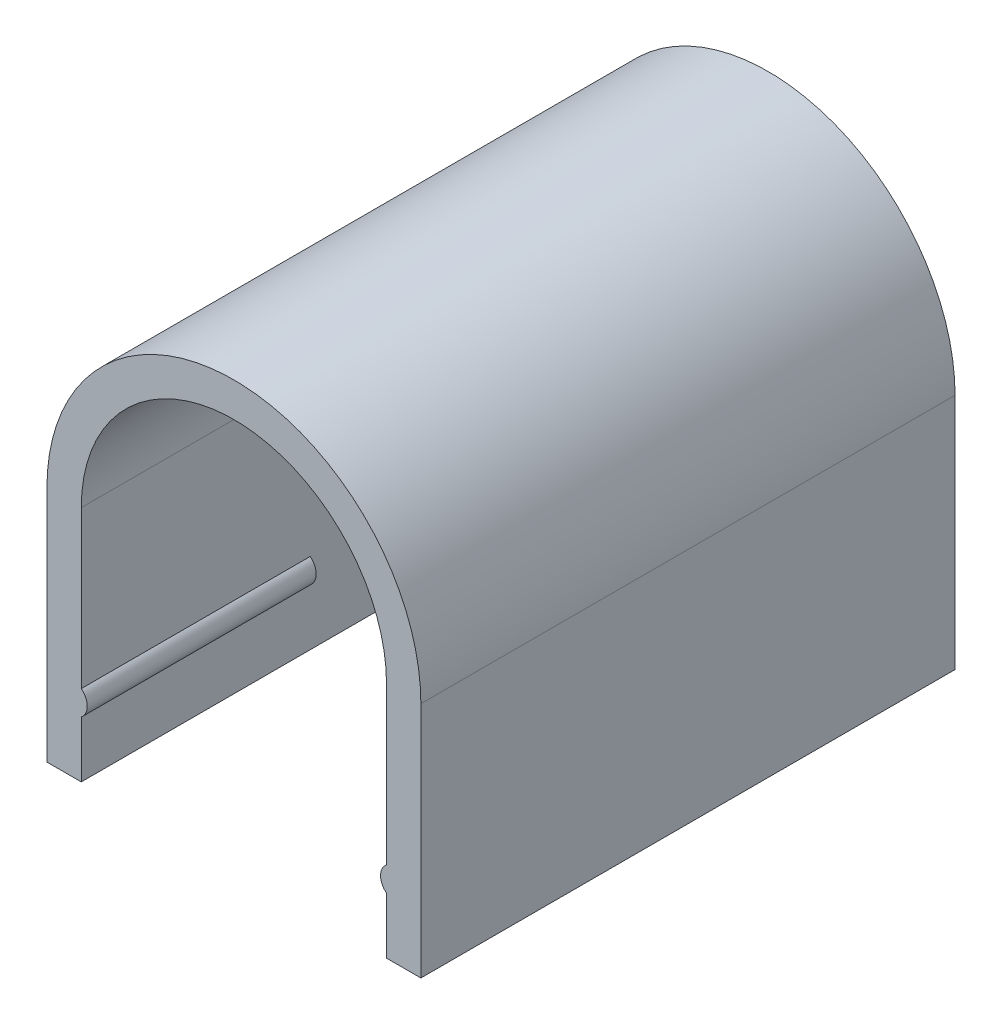
ISO-10303-21;
HEADER;
FILE_DESCRIPTION(('STEP AP214'),'2;1');
FILE_NAME('part.step','',(''),(''),'','','');
FILE_SCHEMA(('AUTOMOTIVE_DESIGN { 1 0 10303 214 1 1 1 1 }'));
ENDSEC;
DATA;
#1=APPLICATION_CONTEXT('core data for automotive mechanical design processes');
#2=APPLICATION_PROTOCOL_DEFINITION('international standard','automotive_design',2000,#1);
#3=PRODUCT_CONTEXT('',#1,'mechanical');
#4=PRODUCT('Part','Part','',(#3));
#5=PRODUCT_RELATED_PRODUCT_CATEGORY('part','',(#4));
#6=PRODUCT_DEFINITION_FORMATION('','',#4);
#7=PRODUCT_DEFINITION_CONTEXT('part definition',#1,'design');
#8=PRODUCT_DEFINITION('design','',#6,#7);
#9=PRODUCT_DEFINITION_SHAPE('','',#8);
#10=(LENGTH_UNIT() NAMED_UNIT(*) SI_UNIT(.MILLI.,.METRE.));
#11=(NAMED_UNIT(*) PLANE_ANGLE_UNIT() SI_UNIT($,.RADIAN.));
#12=(NAMED_UNIT(*) SI_UNIT($,.STERADIAN.) SOLID_ANGLE_UNIT());
#13=UNCERTAINTY_MEASURE_WITH_UNIT(LENGTH_MEASURE(1.E-05),#10,'distance_accuracy_value','');
#14=(GEOMETRIC_REPRESENTATION_CONTEXT(3) GLOBAL_UNCERTAINTY_ASSIGNED_CONTEXT((#13)) GLOBAL_UNIT_ASSIGNED_CONTEXT((#10,
#11,#12)) REPRESENTATION_CONTEXT('',''));
#15=CARTESIAN_POINT('',(0.,0.,0.));
#16=DIRECTION('',(0.,0.,1.));
#17=DIRECTION('',(1.,0.,0.));
#18=AXIS2_PLACEMENT_3D('',#15,#16,#17);
#19=CARTESIAN_POINT('',(8.94999999999984,424.435617565556,316.263553390594));
#20=DIRECTION('',(-1.,0.,0.));
#21=DIRECTION('',(0.,0.,1.));
#22=AXIS2_PLACEMENT_3D('',#19,#20,#21);
#23=PLANE('',#22);
#24=DIRECTION('',(0.,0.,1.));
#25=VECTOR('',#24,1.);
#26=CARTESIAN_POINT('',(8.94999999999984,439.999617565556,319.000000000001));
#27=LINE('',#26,#25);
#28=CARTESIAN_POINT('',(8.94999999999983,439.999617565556,316.263553390594));
#29=VERTEX_POINT('',#28);
#30=CARTESIAN_POINT('',(8.94999999999983,439.999617565556,321.736446609408));
#31=VERTEX_POINT('',#30);
#32=EDGE_CURVE('E129',#29,#31,#27,.T.);
#33=ORIENTED_EDGE('',*,*,#32,.F.);
#34=DIRECTION('',(0.,1.,0.));
#35=VECTOR('',#34,1.);
#36=CARTESIAN_POINT('',(8.94999999999979,424.435617565556,316.263553390594));
#37=LINE('',#36,#35);
#38=CARTESIAN_POINT('',(8.94999999999982,424.435617565556,316.263553390594));
#39=VERTEX_POINT('',#38);
#40=EDGE_CURVE('E104',#39,#29,#37,.T.);
#41=ORIENTED_EDGE('',*,*,#40,.F.);
#42=DIRECTION('',(0.,0.,-1.));
#43=VECTOR('',#42,1.);
#44=CARTESIAN_POINT('',(8.94999999999983,424.435617565556,329.000000000001));
#45=LINE('',#44,#43);
#46=CARTESIAN_POINT('',(8.94999999999983,424.435617565556,321.736446609408));
#47=VERTEX_POINT('',#46);
#48=EDGE_CURVE('E160',#47,#39,#45,.T.);
#49=ORIENTED_EDGE('',*,*,#48,.F.);
#50=DIRECTION('',(0.,1.,0.));
#51=VECTOR('',#50,1.);
#52=CARTESIAN_POINT('',(8.94999999999983,424.435617565556,321.736446609408));
#53=LINE('',#52,#51);
#54=EDGE_CURVE('E113',#31,#47,#53,.F.);
#55=ORIENTED_EDGE('',*,*,#54,.F.);
#56=EDGE_LOOP('',(#33,#41,#49,#55));
#57=FACE_BOUND('',#56,.T.);
#58=ADVANCED_FACE('F16',(#57),#23,.T.);
#59=CARTESIAN_POINT('',(9.80466798838485,428.925799984371,329.000000000001));
#60=DIRECTION('',(0.,0.,1.));
#61=DIRECTION('',(1.,0.,0.));
#62=AXIS2_PLACEMENT_3D('',#59,#60,#61);
#63=PLANE('',#62);
#64=DIRECTION('',(0.,1.,0.));
#65=VECTOR('',#64,1.);
#66=CARTESIAN_POINT('',(9.99999999999972,428.925799984371,329.000000000001));
#67=LINE('',#66,#65);
#68=CARTESIAN_POINT('',(9.99999999999972,428.122860904432,329.000000000001));
#69=VERTEX_POINT('',#68);
#70=CARTESIAN_POINT('',(9.99999999999972,429.728739064309,329.000000000001));
#71=VERTEX_POINT('',#70);
#72=EDGE_CURVE('E91',#69,#71,#67,.T.);
#73=ORIENTED_EDGE('',*,*,#72,.F.);
#74=CARTESIAN_POINT('',(10.6298158491508,428.925799984371,329.000000000001));
#75=DIRECTION('',(0.,0.,-1.));
#76=DIRECTION('',(-1.,0.,0.));
#77=AXIS2_PLACEMENT_3D('',#74,#75,#76);
#78=CIRCLE('',#77,1.02047987238082);
#79=EDGE_CURVE('E19',#71,#69,#78,.F.);
#80=ORIENTED_EDGE('',*,*,#79,.F.);
#81=EDGE_LOOP('',(#73,#80));
#82=FACE_BOUND('',#81,.T.);
#83=ADVANCED_FACE('F613',(#82),#63,.F.);
#84=CARTESIAN_POINT('',(9.99999999999972,424.435617565556,315.213553390594));
#85=DIRECTION('',(-0.707106781186553,0.,-0.707106781186542));
#86=DIRECTION('',(-0.707106781186542,0.,0.707106781186553));
#87=AXIS2_PLACEMENT_3D('',#84,#85,#86);
#88=PLANE('',#87);
#89=DIRECTION('',(-0.707106781186508,0.,0.707106781186587));
#90=VECTOR('',#89,1.);
#91=CARTESIAN_POINT('',(9.99999999999972,439.999617565556,315.213553390594));
#92=LINE('',#91,#90);
#93=CARTESIAN_POINT('',(9.99999999999971,439.999617565556,315.213553390594));
#94=VERTEX_POINT('',#93);
#95=EDGE_CURVE('E132',#94,#29,#92,.T.);
#96=ORIENTED_EDGE('',*,*,#95,.F.);
#97=DIRECTION('',(0.,-1.,0.));
#98=VECTOR('',#97,1.);
#99=CARTESIAN_POINT('',(9.99999999999972,424.435617565556,315.213553390594));
#100=LINE('',#99,#98);
#101=CARTESIAN_POINT('',(9.99999999999972,424.435617565556,315.213553390594));
#102=VERTEX_POINT('',#101);
#103=EDGE_CURVE('E154',#102,#94,#100,.F.);
#104=ORIENTED_EDGE('',*,*,#103,.F.);
#105=DIRECTION('',(0.707106781186508,0.,-0.707106781186587));
#106=VECTOR('',#105,1.);
#107=CARTESIAN_POINT('',(8.94999999999984,424.435617565556,316.263553390594));
#108=LINE('',#107,#106);
#109=EDGE_CURVE('E138',#39,#102,#108,.T.);
#110=ORIENTED_EDGE('',*,*,#109,.F.);
#111=ORIENTED_EDGE('',*,*,#40,.T.);
#112=EDGE_LOOP('',(#96,#104,#110,#111));
#113=FACE_BOUND('',#112,.T.);
#114=ADVANCED_FACE('F135',(#113),#88,.T.);
#115=CARTESIAN_POINT('',(9.47499999999978,439.999617565556,319.000000000001));
#116=DIRECTION('',(0.,1.,0.));
#117=DIRECTION('',(0.,0.,1.));
#118=AXIS2_PLACEMENT_3D('',#115,#116,#117);
#119=PLANE('',#118);
#120=DIRECTION('',(0.,0.,1.));
#121=VECTOR('',#120,1.);
#122=CARTESIAN_POINT('',(9.99999999999971,439.999617565556,329.000000000001));
#123=LINE('',#122,#121);
#124=CARTESIAN_POINT('',(9.99999999999974,439.999617565556,322.786446609408));
#125=VERTEX_POINT('',#124);
#126=EDGE_CURVE('E143',#94,#125,#123,.T.);
#127=ORIENTED_EDGE('',*,*,#126,.F.);
#128=ORIENTED_EDGE('',*,*,#95,.T.);
#129=ORIENTED_EDGE('',*,*,#32,.T.);
#130=DIRECTION('',(0.707106781186564,0.,0.707106781186532));
#131=VECTOR('',#130,1.);
#132=CARTESIAN_POINT('',(8.94999999999983,439.999617565556,321.736446609408));
#133=LINE('',#132,#131);
#134=EDGE_CURVE('E145',#125,#31,#133,.F.);
#135=ORIENTED_EDGE('',*,*,#134,.F.);
#136=EDGE_LOOP('',(#127,#128,#129,#135));
#137=FACE_BOUND('',#136,.T.);
#138=ADVANCED_FACE('F141',(#137),#119,.T.);
#139=CARTESIAN_POINT('',(8.94999999999983,424.435617565556,321.736446609408));
#140=DIRECTION('',(-0.707106781186532,0.,0.707106781186564));
#141=DIRECTION('',(0.707106781186564,0.,0.707106781186532));
#142=AXIS2_PLACEMENT_3D('',#139,#140,#141);
#143=PLANE('',#142);
#144=ORIENTED_EDGE('',*,*,#134,.T.);
#145=ORIENTED_EDGE('',*,*,#54,.T.);
#146=DIRECTION('',(-0.707106781186511,0.,-0.707106781186584));
#147=VECTOR('',#146,1.);
#148=CARTESIAN_POINT('',(9.99999999999972,424.435617565556,322.786446609408));
#149=LINE('',#148,#147);
#150=CARTESIAN_POINT('',(9.99999999999972,424.435617565556,322.786446609408));
#151=VERTEX_POINT('',#150);
#152=EDGE_CURVE('E167',#151,#47,#149,.T.);
#153=ORIENTED_EDGE('',*,*,#152,.F.);
#154=DIRECTION('',(0.,-1.,0.));
#155=VECTOR('',#154,1.);
#156=CARTESIAN_POINT('',(9.99999999999972,424.435617565556,322.786446609408));
#157=LINE('',#156,#155);
#158=EDGE_CURVE('E233',#125,#151,#157,.T.);
#159=ORIENTED_EDGE('',*,*,#158,.F.);
#160=EDGE_LOOP('',(#144,#145,#153,#159));
#161=FACE_BOUND('',#160,.T.);
#162=ADVANCED_FACE('F590',(#161),#143,.T.);
#163=CARTESIAN_POINT('',(-9.80466798838542,428.925799984371,329.000000000001));
#164=DIRECTION('',(0.,0.,1.));
#165=DIRECTION('',(1.,0.,0.));
#166=AXIS2_PLACEMENT_3D('',#163,#164,#165);
#167=PLANE('',#166);
#168=DIRECTION('',(0.,1.,0.));
#169=VECTOR('',#168,1.);
#170=CARTESIAN_POINT('',(-10.0000000000003,428.925799984371,329.000000000001));
#171=LINE('',#170,#169);
#172=CARTESIAN_POINT('',(-10.0000000000003,429.728739064309,329.000000000001));
#173=VERTEX_POINT('',#172);
#174=CARTESIAN_POINT('',(-10.0000000000003,428.122860904432,329.000000000001));
#175=VERTEX_POINT('',#174);
#176=EDGE_CURVE('E171',#173,#175,#171,.F.);
#177=ORIENTED_EDGE('',*,*,#176,.F.);
#178=CARTESIAN_POINT('',(-10.6298158491514,428.925799984371,329.000000000001));
#179=DIRECTION('',(0.,0.,-1.));
#180=DIRECTION('',(-1.,0.,0.));
#181=AXIS2_PLACEMENT_3D('',#178,#179,#180);
#182=CIRCLE('',#181,1.02047987238082);
#183=EDGE_CURVE('E217',#175,#173,#182,.F.);
#184=ORIENTED_EDGE('',*,*,#183,.F.);
#185=EDGE_LOOP('',(#177,#184));
#186=FACE_BOUND('',#185,.T.);
#187=ADVANCED_FACE('F582',(#186),#167,.F.);
#188=CARTESIAN_POINT('',(-10.1767766952968,424.435617565556,322.963223304704));
#189=DIRECTION('',(0.707106781186532,0.,0.707106781186564));
#190=DIRECTION('',(0.707106781186564,0.,-0.707106781186532));
#191=AXIS2_PLACEMENT_3D('',#188,#189,#190);
#192=PLANE('',#191);
#193=DIRECTION('',(0.,1.,0.));
#194=VECTOR('',#193,1.);
#195=CARTESIAN_POINT('',(-8.95000000000018,424.435617565556,321.736446609408));
#196=LINE('',#195,#194);
#197=CARTESIAN_POINT('',(-8.95000000000018,439.999617565556,321.736446609408));
#198=VERTEX_POINT('',#197);
#199=CARTESIAN_POINT('',(-8.95000000000028,424.435617565699,321.736446609408));
#200=VERTEX_POINT('',#199);
#201=EDGE_CURVE('E190',#198,#200,#196,.F.);
#202=ORIENTED_EDGE('',*,*,#201,.F.);
#203=DIRECTION('',(0.70710678118659,0.,-0.707106781186505));
#204=VECTOR('',#203,1.);
#205=CARTESIAN_POINT('',(-10.0000000000003,439.999617565556,322.786446609408));
#206=LINE('',#205,#204);
#207=CARTESIAN_POINT('',(-10.0000000000003,439.999617565556,322.786446609408));
#208=VERTEX_POINT('',#207);
#209=EDGE_CURVE('E293',#208,#198,#206,.T.);
#210=ORIENTED_EDGE('',*,*,#209,.F.);
#211=DIRECTION('',(0.,1.,0.));
#212=VECTOR('',#211,1.);
#213=CARTESIAN_POINT('',(-10.0000000000003,440.000000000001,322.786446609408));
#214=LINE('',#213,#212);
#215=CARTESIAN_POINT('',(-10.0000000000004,424.435617565712,322.786446609408));
#216=VERTEX_POINT('',#215);
#217=EDGE_CURVE('E281',#216,#208,#214,.T.);
#218=ORIENTED_EDGE('',*,*,#217,.F.);
#219=DIRECTION('',(0.707106781186564,0.,-0.707106781186532));
#220=VECTOR('',#219,1.);
#221=CARTESIAN_POINT('',(-10.1767766952968,424.435617565712,322.963223304704));
#222=LINE('',#221,#220);
#223=EDGE_CURVE('E301',#216,#200,#222,.T.);
#224=ORIENTED_EDGE('',*,*,#223,.T.);
#225=EDGE_LOOP('',(#202,#210,#218,#224));
#226=FACE_BOUND('',#225,.T.);
#227=ADVANCED_FACE('F349',(#226),#192,.T.);
#228=CARTESIAN_POINT('',(-9.56338834764849,439.999617565556,319.000000000001));
#229=DIRECTION('',(0.,1.,0.));
#230=DIRECTION('',(0.,0.,1.));
#231=AXIS2_PLACEMENT_3D('',#228,#229,#230);
#232=PLANE('',#231);
#233=DIRECTION('',(0.,0.,-1.));
#234=VECTOR('',#233,1.);
#235=CARTESIAN_POINT('',(-8.95000000000018,439.999617565556,321.736446609408));
#236=LINE('',#235,#234);
#237=CARTESIAN_POINT('',(-8.95000000000017,439.999617565556,316.263553390594));
#238=VERTEX_POINT('',#237);
#239=EDGE_CURVE('E177',#238,#198,#236,.F.);
#240=ORIENTED_EDGE('',*,*,#239,.F.);
#241=DIRECTION('',(-0.707106781186542,0.,-0.707106781186553));
#242=VECTOR('',#241,1.);
#243=CARTESIAN_POINT('',(-8.95000000000017,439.999617565556,316.263553390594));
#244=LINE('',#243,#242);
#245=CARTESIAN_POINT('',(-10.0000000000003,439.999617565556,315.213553390594));
#246=VERTEX_POINT('',#245);
#247=EDGE_CURVE('E288',#246,#238,#244,.F.);
#248=ORIENTED_EDGE('',*,*,#247,.F.);
#249=DIRECTION('',(0.,0.,-1.));
#250=VECTOR('',#249,1.);
#251=CARTESIAN_POINT('',(-10.0000000000003,439.999617565556,329.000000000001));
#252=LINE('',#251,#250);
#253=EDGE_CURVE('E278',#208,#246,#252,.T.);
#254=ORIENTED_EDGE('',*,*,#253,.F.);
#255=ORIENTED_EDGE('',*,*,#209,.T.);
#256=EDGE_LOOP('',(#240,#248,#254,#255));
#257=FACE_BOUND('',#256,.T.);
#258=ADVANCED_FACE('F366',(#257),#232,.T.);
#259=CARTESIAN_POINT('',(-8.95000000000017,424.435617565556,316.263553390594));
#260=DIRECTION('',(0.707106781186553,0.,-0.707106781186542));
#261=DIRECTION('',(-0.707106781186542,0.,-0.707106781186553));
#262=AXIS2_PLACEMENT_3D('',#259,#260,#261);
#263=PLANE('',#262);
#264=DIRECTION('',(0.,1.,0.));
#265=VECTOR('',#264,1.);
#266=CARTESIAN_POINT('',(-8.95000000000018,424.435617565556,316.263553390594));
#267=LINE('',#266,#265);
#268=CARTESIAN_POINT('',(-8.95000000000017,424.435617565556,316.263553390594));
#269=VERTEX_POINT('',#268);
#270=EDGE_CURVE('E174',#269,#238,#267,.T.);
#271=ORIENTED_EDGE('',*,*,#270,.F.);
#272=DIRECTION('',(-0.707106781186542,0.,-0.707106781186553));
#273=VECTOR('',#272,1.);
#274=CARTESIAN_POINT('',(-8.95000000000017,424.435617565556,316.263553390594));
#275=LINE('',#274,#273);
#276=CARTESIAN_POINT('',(-10.0000000000003,424.43561756566,315.213553390594));
#277=VERTEX_POINT('',#276);
#278=EDGE_CURVE('E178',#269,#277,#275,.T.);
#279=ORIENTED_EDGE('',*,*,#278,.T.);
#280=DIRECTION('',(0.,1.,0.));
#281=VECTOR('',#280,1.);
#282=CARTESIAN_POINT('',(-10.0000000000003,440.000000000001,315.213553390594));
#283=LINE('',#282,#281);
#284=EDGE_CURVE('E274',#246,#277,#283,.F.);
#285=ORIENTED_EDGE('',*,*,#284,.F.);
#286=ORIENTED_EDGE('',*,*,#247,.T.);
#287=EDGE_LOOP('',(#271,#279,#285,#286));
#288=FACE_BOUND('',#287,.T.);
#289=ADVANCED_FACE('F363',(#288),#263,.T.);
#290=CARTESIAN_POINT('',(-8.95000000000018,424.435617565556,321.736446609408));
#291=DIRECTION('',(1.,0.,0.));
#292=DIRECTION('',(0.,0.,-1.));
#293=AXIS2_PLACEMENT_3D('',#290,#291,#292);
#294=PLANE('',#293);
#295=ORIENTED_EDGE('',*,*,#239,.T.);
#296=ORIENTED_EDGE('',*,*,#201,.T.);
#297=DIRECTION('',(0.,0.,-1.));
#298=VECTOR('',#297,1.);
#299=CARTESIAN_POINT('',(-8.95000000000017,424.435617565712,329.000000000001));
#300=LINE('',#299,#298);
#301=EDGE_CURVE('E181',#269,#200,#300,.F.);
#302=ORIENTED_EDGE('',*,*,#301,.F.);
#303=ORIENTED_EDGE('',*,*,#270,.T.);
#304=EDGE_LOOP('',(#295,#296,#302,#303));
#305=FACE_BOUND('',#304,.T.);
#306=ADVANCED_FACE('F355',(#305),#294,.T.);
#307=CARTESIAN_POINT('',(12.2499999999997,424.435617565556,329.000000000001));
#308=DIRECTION('',(0.,-1.,0.));
#309=DIRECTION('',(0.,0.,-1.));
#310=AXIS2_PLACEMENT_3D('',#307,#308,#309);
#311=PLANE('',#310);
#312=DIRECTION('',(0.,0.,1.));
#313=VECTOR('',#312,1.);
#314=CARTESIAN_POINT('',(12.2499999999997,424.435617565556,329.000000000001));
#315=LINE('',#314,#313);
#316=CARTESIAN_POINT('',(12.2499999999997,424.435617565556,344.000000000001));
#317=VERTEX_POINT('',#316);
#318=CARTESIAN_POINT('',(12.2499999999997,424.435617565556,309.000000000001));
#319=VERTEX_POINT('',#318);
#320=EDGE_CURVE('E184',#317,#319,#315,.F.);
#321=ORIENTED_EDGE('',*,*,#320,.F.);
#322=DIRECTION('',(-1.,0.,0.));
#323=VECTOR('',#322,1.);
#324=CARTESIAN_POINT('',(-2.79776202205539E-13,424.435617565556,344.000000000001));
#325=LINE('',#324,#323);
#326=CARTESIAN_POINT('',(9.99999999999972,424.435617565556,344.000000000001));
#327=VERTEX_POINT('',#326);
#328=EDGE_CURVE('E243',#317,#327,#325,.T.);
#329=ORIENTED_EDGE('',*,*,#328,.T.);
#330=DIRECTION('',(0.,0.,1.));
#331=VECTOR('',#330,1.);
#332=CARTESIAN_POINT('',(9.99999999999972,424.435617565556,329.000000000001));
#333=LINE('',#332,#331);
#334=EDGE_CURVE('E227',#151,#327,#333,.T.);
#335=ORIENTED_EDGE('',*,*,#334,.F.);
#336=ORIENTED_EDGE('',*,*,#152,.T.);
#337=ORIENTED_EDGE('',*,*,#48,.T.);
#338=ORIENTED_EDGE('',*,*,#109,.T.);
#339=DIRECTION('',(0.,0.,1.));
#340=VECTOR('',#339,1.);
#341=CARTESIAN_POINT('',(9.99999999999972,424.435617565556,329.000000000001));
#342=LINE('',#341,#340);
#343=CARTESIAN_POINT('',(9.99999999999972,424.435617565556,309.000000000001));
#344=VERTEX_POINT('',#343);
#345=EDGE_CURVE('E156',#344,#102,#342,.T.);
#346=ORIENTED_EDGE('',*,*,#345,.F.);
#347=DIRECTION('',(-1.,0.,0.));
#348=VECTOR('',#347,1.);
#349=CARTESIAN_POINT('',(-2.79776202205539E-13,424.435617565556,309.000000000001));
#350=LINE('',#349,#348);
#351=EDGE_CURVE('E269',#319,#344,#350,.T.);
#352=ORIENTED_EDGE('',*,*,#351,.F.);
#353=EDGE_LOOP('',(#321,#329,#335,#336,#337,#338,#346,#352));
#354=FACE_BOUND('',#353,.T.);
#355=ADVANCED_FACE('F325',(#354),#311,.T.);
#356=CARTESIAN_POINT('',(10.6298158491508,428.925799984371,344.000000000001));
#357=DIRECTION('',(0.,0.,-1.));
#358=DIRECTION('',(-1.,0.,0.));
#359=AXIS2_PLACEMENT_3D('',#356,#357,#358);
#360=CYLINDRICAL_SURFACE('',#359,1.02047987238082);
#361=ORIENTED_EDGE('',*,*,#79,.T.);
#362=DIRECTION('',(0.,0.,1.));
#363=VECTOR('',#362,1.);
#364=CARTESIAN_POINT('',(9.99999999999972,428.122860904432,329.000000000001));
#365=LINE('',#364,#363);
#366=CARTESIAN_POINT('',(9.99999999999972,428.122860904432,344.000000000001));
#367=VERTEX_POINT('',#366);
#368=EDGE_CURVE('E239',#367,#69,#365,.F.);
#369=ORIENTED_EDGE('',*,*,#368,.F.);
#370=CARTESIAN_POINT('',(10.6298158491508,428.925799984371,344.000000000001));
#371=DIRECTION('',(0.,0.,-1.));
#372=DIRECTION('',(-1.,0.,0.));
#373=AXIS2_PLACEMENT_3D('',#370,#371,#372);
#374=CIRCLE('',#373,1.02047987238082);
#375=CARTESIAN_POINT('',(9.99999999999972,429.728739064309,344.000000000001));
#376=VERTEX_POINT('',#375);
#377=EDGE_CURVE('E210',#367,#376,#374,.T.);
#378=ORIENTED_EDGE('',*,*,#377,.T.);
#379=DIRECTION('',(0.,0.,1.));
#380=VECTOR('',#379,1.);
#381=CARTESIAN_POINT('',(9.99999999999972,429.728739064309,329.000000000001));
#382=LINE('',#381,#380);
#383=EDGE_CURVE('E237',#71,#376,#382,.T.);
#384=ORIENTED_EDGE('',*,*,#383,.F.);
#385=EDGE_LOOP('',(#361,#369,#378,#384));
#386=FACE_BOUND('',#385,.T.);
#387=ADVANCED_FACE('F449',(#386),#360,.T.);
#388=CARTESIAN_POINT('',(9.99999999999972,424.435617565556,329.000000000001));
#389=DIRECTION('',(-1.,0.,0.));
#390=DIRECTION('',(0.,-1.,0.));
#391=AXIS2_PLACEMENT_3D('',#388,#389,#390);
#392=PLANE('',#391);
#393=ORIENTED_EDGE('',*,*,#334,.T.);
#394=DIRECTION('',(0.,1.,0.));
#395=VECTOR('',#394,1.);
#396=CARTESIAN_POINT('',(9.99999999999972,438.342808782779,344.000000000001));
#397=LINE('',#396,#395);
#398=EDGE_CURVE('E212',#327,#367,#397,.T.);
#399=ORIENTED_EDGE('',*,*,#398,.T.);
#400=ORIENTED_EDGE('',*,*,#368,.T.);
#401=ORIENTED_EDGE('',*,*,#72,.T.);
#402=ORIENTED_EDGE('',*,*,#383,.T.);
#403=DIRECTION('',(0.,1.,0.));
#404=VECTOR('',#403,1.);
#405=CARTESIAN_POINT('',(9.99999999999972,438.342808782779,344.000000000001));
#406=LINE('',#405,#404);
#407=CARTESIAN_POINT('',(9.99999999999972,440.000000000001,344.000000000001));
#408=VERTEX_POINT('',#407);
#409=EDGE_CURVE('E209',#376,#408,#406,.T.);
#410=ORIENTED_EDGE('',*,*,#409,.T.);
#411=DIRECTION('',(0.,0.,-1.));
#412=VECTOR('',#411,1.);
#413=CARTESIAN_POINT('',(9.99999999999972,440.000000000001,329.000000000001));
#414=LINE('',#413,#412);
#415=CARTESIAN_POINT('',(9.99999999999972,440.000000000001,309.000000000001));
#416=VERTEX_POINT('',#415);
#417=EDGE_CURVE('E220',#408,#416,#414,.T.);
#418=ORIENTED_EDGE('',*,*,#417,.T.);
#419=DIRECTION('',(0.,1.,0.));
#420=VECTOR('',#419,1.);
#421=CARTESIAN_POINT('',(9.99999999999972,438.342808782779,309.000000000001));
#422=LINE('',#421,#420);
#423=EDGE_CURVE('E216',#344,#416,#422,.T.);
#424=ORIENTED_EDGE('',*,*,#423,.F.);
#425=ORIENTED_EDGE('',*,*,#345,.T.);
#426=ORIENTED_EDGE('',*,*,#103,.T.);
#427=ORIENTED_EDGE('',*,*,#126,.T.);
#428=ORIENTED_EDGE('',*,*,#158,.T.);
#429=EDGE_LOOP('',(#393,#399,#400,#401,#402,#410,#418,#424,#425,#426,#427,#428));
#430=FACE_BOUND('',#429,.T.);
#431=ADVANCED_FACE('F318',(#430),#392,.T.);
#432=CARTESIAN_POINT('',(-2.84772205816353E-13,440.000000000001,329.000000000001));
#433=DIRECTION('',(0.,0.,-1.));
#434=DIRECTION('',(-1.,0.,0.));
#435=AXIS2_PLACEMENT_3D('',#432,#433,#434);
#436=CYLINDRICAL_SURFACE('',#435,10.);
#437=CARTESIAN_POINT('',(-2.84772205816353E-13,440.000000000001,309.000000000001));
#438=DIRECTION('',(0.,0.,-1.));
#439=DIRECTION('',(-1.,0.,0.));
#440=AXIS2_PLACEMENT_3D('',#437,#438,#439);
#441=CIRCLE('',#440,10.);
#442=CARTESIAN_POINT('',(-10.0000000000003,440.000000000001,309.000000000001));
#443=VERTEX_POINT('',#442);
#444=EDGE_CURVE('E213',#416,#443,#441,.F.);
#445=ORIENTED_EDGE('',*,*,#444,.F.);
#446=ORIENTED_EDGE('',*,*,#417,.F.);
#447=CARTESIAN_POINT('',(-2.84772205816353E-13,440.000000000001,344.000000000001));
#448=DIRECTION('',(0.,0.,-1.));
#449=DIRECTION('',(-1.,0.,0.));
#450=AXIS2_PLACEMENT_3D('',#447,#448,#449);
#451=CIRCLE('',#450,10.);
#452=CARTESIAN_POINT('',(-10.0000000000003,440.000000000001,344.000000000001));
#453=VERTEX_POINT('',#452);
#454=EDGE_CURVE('E207',#408,#453,#451,.F.);
#455=ORIENTED_EDGE('',*,*,#454,.T.);
#456=DIRECTION('',(0.,0.,-1.));
#457=VECTOR('',#456,1.);
#458=CARTESIAN_POINT('',(-10.0000000000003,440.000000000001,329.000000000001));
#459=LINE('',#458,#457);
#460=EDGE_CURVE('E277',#443,#453,#459,.F.);
#461=ORIENTED_EDGE('',*,*,#460,.F.);
#462=EDGE_LOOP('',(#445,#446,#455,#461));
#463=FACE_BOUND('',#462,.T.);
#464=ADVANCED_FACE('F451',(#463),#436,.F.);
#465=CARTESIAN_POINT('',(-10.6298158491514,428.925799984371,344.000000000001));
#466=DIRECTION('',(0.,0.,-1.));
#467=DIRECTION('',(-1.,0.,0.));
#468=AXIS2_PLACEMENT_3D('',#465,#466,#467);
#469=CYLINDRICAL_SURFACE('',#468,1.02047987238082);
#470=ORIENTED_EDGE('',*,*,#183,.T.);
#471=DIRECTION('',(0.,0.,-1.));
#472=VECTOR('',#471,1.);
#473=CARTESIAN_POINT('',(-10.0000000000003,429.728739064309,329.000000000001));
#474=LINE('',#473,#472);
#475=CARTESIAN_POINT('',(-10.0000000000003,429.728739064309,344.000000000001));
#476=VERTEX_POINT('',#475);
#477=EDGE_CURVE('E219',#476,#173,#474,.T.);
#478=ORIENTED_EDGE('',*,*,#477,.F.);
#479=CARTESIAN_POINT('',(-10.6298158491514,428.925799984371,344.000000000001));
#480=DIRECTION('',(0.,0.,-1.));
#481=DIRECTION('',(-1.,0.,0.));
#482=AXIS2_PLACEMENT_3D('',#479,#480,#481);
#483=CIRCLE('',#482,1.02047987238082);
#484=CARTESIAN_POINT('',(-10.0000000000003,428.122860904432,344.000000000001));
#485=VERTEX_POINT('',#484);
#486=EDGE_CURVE('E203',#476,#485,#483,.T.);
#487=ORIENTED_EDGE('',*,*,#486,.T.);
#488=DIRECTION('',(0.,0.,-1.));
#489=VECTOR('',#488,1.);
#490=CARTESIAN_POINT('',(-10.0000000000003,428.122860904432,329.000000000001));
#491=LINE('',#490,#489);
#492=EDGE_CURVE('E225',#175,#485,#491,.F.);
#493=ORIENTED_EDGE('',*,*,#492,.F.);
#494=EDGE_LOOP('',(#470,#478,#487,#493));
#495=FACE_BOUND('',#494,.T.);
#496=ADVANCED_FACE('F452',(#495),#469,.T.);
#497=CARTESIAN_POINT('',(-10.0000000000003,440.000000000001,329.000000000001));
#498=DIRECTION('',(1.,0.,0.));
#499=DIRECTION('',(0.,0.,-1.));
#500=AXIS2_PLACEMENT_3D('',#497,#498,#499);
#501=PLANE('',#500);
#502=ORIENTED_EDGE('',*,*,#460,.T.);
#503=DIRECTION('',(0.,1.,0.));
#504=VECTOR('',#503,1.);
#505=CARTESIAN_POINT('',(-10.0000000000003,438.342808782779,344.000000000001));
#506=LINE('',#505,#504);
#507=EDGE_CURVE('E206',#453,#476,#506,.F.);
#508=ORIENTED_EDGE('',*,*,#507,.T.);
#509=ORIENTED_EDGE('',*,*,#477,.T.);
#510=ORIENTED_EDGE('',*,*,#176,.T.);
#511=ORIENTED_EDGE('',*,*,#492,.T.);
#512=DIRECTION('',(0.,1.,0.));
#513=VECTOR('',#512,1.);
#514=CARTESIAN_POINT('',(-10.0000000000003,438.342808782779,344.000000000001));
#515=LINE('',#514,#513);
#516=CARTESIAN_POINT('',(-10.0000000000003,424.435617565712,344.000000000001));
#517=VERTEX_POINT('',#516);
#518=EDGE_CURVE('E205',#485,#517,#515,.F.);
#519=ORIENTED_EDGE('',*,*,#518,.T.);
#520=DIRECTION('',(0.,0.,-1.));
#521=VECTOR('',#520,1.);
#522=CARTESIAN_POINT('',(-10.0000000000003,424.435617565712,329.000000000001));
#523=LINE('',#522,#521);
#524=EDGE_CURVE('E262',#216,#517,#523,.F.);
#525=ORIENTED_EDGE('',*,*,#524,.F.);
#526=ORIENTED_EDGE('',*,*,#217,.T.);
#527=ORIENTED_EDGE('',*,*,#253,.T.);
#528=ORIENTED_EDGE('',*,*,#284,.T.);
#529=DIRECTION('',(0.,0.,-1.));
#530=VECTOR('',#529,1.);
#531=CARTESIAN_POINT('',(-10.0000000000003,424.435617565712,329.000000000001));
#532=LINE('',#531,#530);
#533=CARTESIAN_POINT('',(-10.0000000000003,424.435617565712,309.000000000001));
#534=VERTEX_POINT('',#533);
#535=EDGE_CURVE('E185',#534,#277,#532,.F.);
#536=ORIENTED_EDGE('',*,*,#535,.F.);
#537=DIRECTION('',(0.,1.,0.));
#538=VECTOR('',#537,1.);
#539=CARTESIAN_POINT('',(-10.0000000000003,438.342808782779,309.000000000001));
#540=LINE('',#539,#538);
#541=EDGE_CURVE('E215',#443,#534,#540,.F.);
#542=ORIENTED_EDGE('',*,*,#541,.F.);
#543=EDGE_LOOP('',(#502,#508,#509,#510,#511,#519,#525,#526,#527,#528,#536,#542));
#544=FACE_BOUND('',#543,.T.);
#545=ADVANCED_FACE('F369',(#544),#501,.T.);
#546=CARTESIAN_POINT('',(-10.0000000000003,424.435617565712,329.000000000001));
#547=DIRECTION('',(0.,-1.,0.));
#548=DIRECTION('',(0.,0.,-1.));
#549=AXIS2_PLACEMENT_3D('',#546,#547,#548);
#550=PLANE('',#549);
#551=ORIENTED_EDGE('',*,*,#301,.T.);
#552=ORIENTED_EDGE('',*,*,#223,.F.);
#553=ORIENTED_EDGE('',*,*,#524,.T.);
#554=DIRECTION('',(-1.,0.,0.));
#555=VECTOR('',#554,1.);
#556=CARTESIAN_POINT('',(-2.79776202205539E-13,424.435617565712,344.000000000001));
#557=LINE('',#556,#555);
#558=CARTESIAN_POINT('',(-12.2500000000003,424.435617565712,344.000000000001));
#559=VERTEX_POINT('',#558);
#560=EDGE_CURVE('E386',#517,#559,#557,.T.);
#561=ORIENTED_EDGE('',*,*,#560,.T.);
#562=DIRECTION('',(0.,0.,1.));
#563=VECTOR('',#562,1.);
#564=CARTESIAN_POINT('',(-12.2500000000003,424.435617565712,329.000000000001));
#565=LINE('',#564,#563);
#566=CARTESIAN_POINT('',(-12.2500000000003,424.435617565712,309.000000000001));
#567=VERTEX_POINT('',#566);
#568=EDGE_CURVE('E403',#567,#559,#565,.T.);
#569=ORIENTED_EDGE('',*,*,#568,.F.);
#570=DIRECTION('',(-1.,0.,0.));
#571=VECTOR('',#570,1.);
#572=CARTESIAN_POINT('',(-2.79776202205539E-13,424.435617565712,309.000000000001));
#573=LINE('',#572,#571);
#574=EDGE_CURVE('E254',#534,#567,#573,.T.);
#575=ORIENTED_EDGE('',*,*,#574,.F.);
#576=ORIENTED_EDGE('',*,*,#535,.T.);
#577=ORIENTED_EDGE('',*,*,#278,.F.);
#578=EDGE_LOOP('',(#551,#552,#553,#561,#569,#575,#576,#577));
#579=FACE_BOUND('',#578,.T.);
#580=ADVANCED_FACE('F357',(#579),#550,.T.);
#581=CARTESIAN_POINT('',(12.2499999999997,440.000000000001,329.000000000001));
#582=DIRECTION('',(1.,0.,0.));
#583=DIRECTION('',(0.,1.,0.));
#584=AXIS2_PLACEMENT_3D('',#581,#582,#583);
#585=PLANE('',#584);
#586=DIRECTION('',(0.,0.,-1.));
#587=VECTOR('',#586,1.);
#588=CARTESIAN_POINT('',(12.2499999999997,440.000000000001,329.000000000001));
#589=LINE('',#588,#587);
#590=CARTESIAN_POINT('',(12.2499999999997,440.000000000001,344.000000000001));
#591=VERTEX_POINT('',#590);
#592=CARTESIAN_POINT('',(12.2499999999997,440.000000000001,309.000000000001));
#593=VERTEX_POINT('',#592);
#594=EDGE_CURVE('E202',#591,#593,#589,.T.);
#595=ORIENTED_EDGE('',*,*,#594,.F.);
#596=DIRECTION('',(0.,1.,0.));
#597=VECTOR('',#596,1.);
#598=CARTESIAN_POINT('',(12.2499999999997,438.342808782779,344.000000000001));
#599=LINE('',#598,#597);
#600=EDGE_CURVE('E246',#591,#317,#599,.F.);
#601=ORIENTED_EDGE('',*,*,#600,.T.);
#602=ORIENTED_EDGE('',*,*,#320,.T.);
#603=DIRECTION('',(0.,1.,0.));
#604=VECTOR('',#603,1.);
#605=CARTESIAN_POINT('',(12.2499999999997,438.342808782779,309.000000000001));
#606=LINE('',#605,#604);
#607=EDGE_CURVE('E251',#593,#319,#606,.F.);
#608=ORIENTED_EDGE('',*,*,#607,.F.);
#609=EDGE_LOOP('',(#595,#601,#602,#608));
#610=FACE_BOUND('',#609,.T.);
#611=ADVANCED_FACE('F473',(#610),#585,.T.);
#612=CARTESIAN_POINT('',(-2.79776202205539E-13,438.342808782779,309.000000000001));
#613=DIRECTION('',(0.,0.,-1.));
#614=DIRECTION('',(-1.,0.,0.));
#615=AXIS2_PLACEMENT_3D('',#612,#613,#614);
#616=PLANE('',#615);
#617=ORIENTED_EDGE('',*,*,#541,.T.);
#618=ORIENTED_EDGE('',*,*,#574,.T.);
#619=DIRECTION('',(0.,1.,0.));
#620=VECTOR('',#619,1.);
#621=CARTESIAN_POINT('',(-12.2500000000003,424.435617565712,309.000000000001));
#622=LINE('',#621,#620);
#623=CARTESIAN_POINT('',(-12.2500000000003,440.000000000001,309.000000000001));
#624=VERTEX_POINT('',#623);
#625=EDGE_CURVE('E257',#624,#567,#622,.F.);
#626=ORIENTED_EDGE('',*,*,#625,.F.);
#627=CARTESIAN_POINT('',(-2.84772205816353E-13,440.000000000001,309.000000000001));
#628=DIRECTION('',(0.,0.,-1.));
#629=DIRECTION('',(-1.,0.,0.));
#630=AXIS2_PLACEMENT_3D('',#627,#628,#629);
#631=CIRCLE('',#630,12.25);
#632=EDGE_CURVE('E199',#593,#624,#631,.F.);
#633=ORIENTED_EDGE('',*,*,#632,.F.);
#634=ORIENTED_EDGE('',*,*,#607,.T.);
#635=ORIENTED_EDGE('',*,*,#351,.T.);
#636=ORIENTED_EDGE('',*,*,#423,.T.);
#637=ORIENTED_EDGE('',*,*,#444,.T.);
#638=EDGE_LOOP('',(#617,#618,#626,#633,#634,#635,#636,#637));
#639=FACE_BOUND('',#638,.T.);
#640=ADVANCED_FACE('F436',(#639),#616,.T.);
#641=CARTESIAN_POINT('',(-12.2500000000003,424.435617565712,329.000000000001));
#642=DIRECTION('',(-1.,0.,0.));
#643=DIRECTION('',(0.,0.,1.));
#644=AXIS2_PLACEMENT_3D('',#641,#642,#643);
#645=PLANE('',#644);
#646=ORIENTED_EDGE('',*,*,#568,.T.);
#647=DIRECTION('',(0.,1.,0.));
#648=VECTOR('',#647,1.);
#649=CARTESIAN_POINT('',(-12.2500000000003,438.342808782779,344.000000000001));
#650=LINE('',#649,#648);
#651=CARTESIAN_POINT('',(-12.2500000000003,440.000000000001,344.000000000001));
#652=VERTEX_POINT('',#651);
#653=EDGE_CURVE('E34',#559,#652,#650,.T.);
#654=ORIENTED_EDGE('',*,*,#653,.T.);
#655=DIRECTION('',(0.,0.,-1.));
#656=VECTOR('',#655,1.);
#657=CARTESIAN_POINT('',(-12.2500000000003,440.000000000001,329.000000000001));
#658=LINE('',#657,#656);
#659=EDGE_CURVE('E25',#624,#652,#658,.F.);
#660=ORIENTED_EDGE('',*,*,#659,.F.);
#661=ORIENTED_EDGE('',*,*,#625,.T.);
#662=EDGE_LOOP('',(#646,#654,#660,#661));
#663=FACE_BOUND('',#662,.T.);
#664=ADVANCED_FACE('F427',(#663),#645,.T.);
#665=CARTESIAN_POINT('',(-2.79776202205539E-13,438.342808782779,344.000000000001));
#666=DIRECTION('',(0.,0.,-1.));
#667=DIRECTION('',(-1.,0.,0.));
#668=AXIS2_PLACEMENT_3D('',#665,#666,#667);
#669=PLANE('',#668);
#670=ORIENTED_EDGE('',*,*,#560,.F.);
#671=ORIENTED_EDGE('',*,*,#518,.F.);
#672=ORIENTED_EDGE('',*,*,#486,.F.);
#673=ORIENTED_EDGE('',*,*,#507,.F.);
#674=ORIENTED_EDGE('',*,*,#454,.F.);
#675=ORIENTED_EDGE('',*,*,#409,.F.);
#676=ORIENTED_EDGE('',*,*,#377,.F.);
#677=ORIENTED_EDGE('',*,*,#398,.F.);
#678=ORIENTED_EDGE('',*,*,#328,.F.);
#679=ORIENTED_EDGE('',*,*,#600,.F.);
#680=CARTESIAN_POINT('',(-2.84772205816353E-13,440.000000000001,344.000000000001));
#681=DIRECTION('',(0.,0.,-1.));
#682=DIRECTION('',(-1.,0.,0.));
#683=AXIS2_PLACEMENT_3D('',#680,#681,#682);
#684=CIRCLE('',#683,12.25);
#685=EDGE_CURVE('E11',#652,#591,#684,.T.);
#686=ORIENTED_EDGE('',*,*,#685,.F.);
#687=ORIENTED_EDGE('',*,*,#653,.F.);
#688=EDGE_LOOP('',(#670,#671,#672,#673,#674,#675,#676,#677,#678,#679,#686,#687));
#689=FACE_BOUND('',#688,.T.);
#690=ADVANCED_FACE('F384',(#689),#669,.F.);
#691=CARTESIAN_POINT('',(-2.84772205816353E-13,440.000000000001,329.000000000001));
#692=DIRECTION('',(0.,0.,-1.));
#693=DIRECTION('',(-1.,0.,0.));
#694=AXIS2_PLACEMENT_3D('',#691,#692,#693);
#695=CYLINDRICAL_SURFACE('',#694,12.25);
#696=ORIENTED_EDGE('',*,*,#659,.T.);
#697=ORIENTED_EDGE('',*,*,#685,.T.);
#698=ORIENTED_EDGE('',*,*,#594,.T.);
#699=ORIENTED_EDGE('',*,*,#632,.T.);
#700=EDGE_LOOP('',(#696,#697,#698,#699));
#701=FACE_BOUND('',#700,.T.);
#702=ADVANCED_FACE('F433',(#701),#695,.T.);
#703=CLOSED_SHELL('',(#58,#83,#114,#138,#162,#187,#227,#258,#289,#306,#355,#387,#431,#464,#496,
#545,#580,#611,#640,#664,#690,#702));
#704=MANIFOLD_SOLID_BREP('B1',#703);
#705=ADVANCED_BREP_SHAPE_REPRESENTATION('',(#18,#704),#14);
#706=SHAPE_DEFINITION_REPRESENTATION(#9,#705);
ENDSEC;
END-ISO-10303-21;
